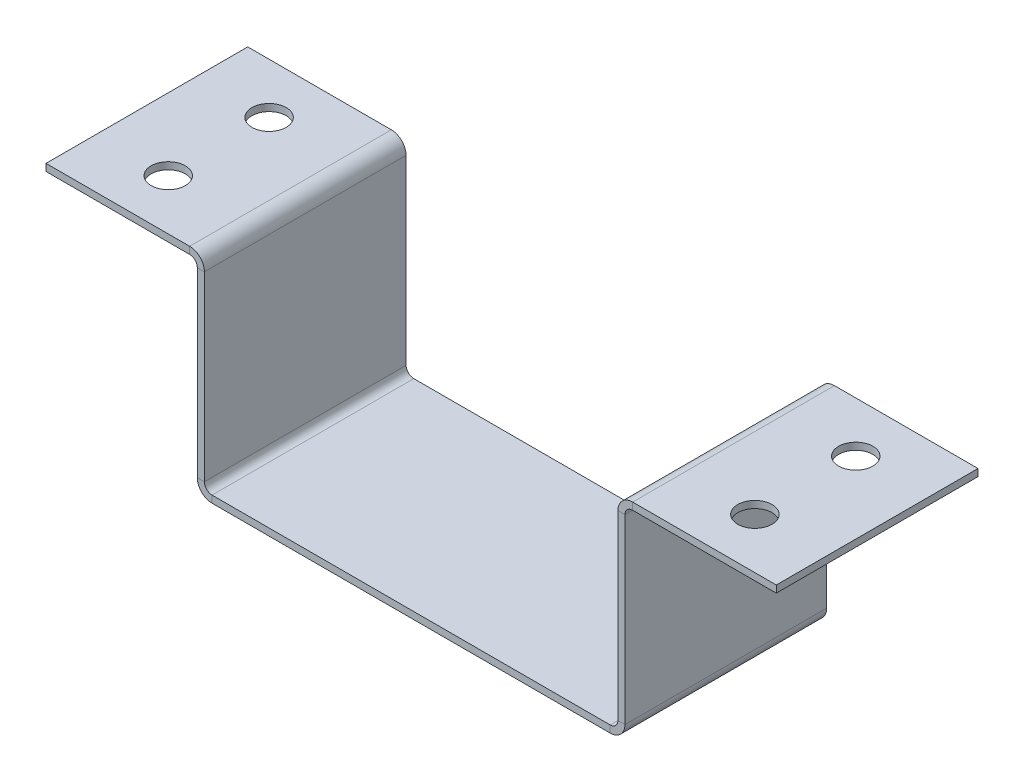
ISO-10303-21;
HEADER;
FILE_DESCRIPTION(('STEP AP214'),'2;1');
FILE_NAME('part.step','',(''),(''),'','','');
FILE_SCHEMA(('AUTOMOTIVE_DESIGN { 1 0 10303 214 1 1 1 1 }'));
ENDSEC;
DATA;
#1=APPLICATION_CONTEXT('core data for automotive mechanical design processes');
#2=APPLICATION_PROTOCOL_DEFINITION('international standard','automotive_design',2000,#1);
#3=PRODUCT_CONTEXT('',#1,'mechanical');
#4=PRODUCT('Part','Part','',(#3));
#5=PRODUCT_RELATED_PRODUCT_CATEGORY('part','',(#4));
#6=PRODUCT_DEFINITION_FORMATION('','',#4);
#7=PRODUCT_DEFINITION_CONTEXT('part definition',#1,'design');
#8=PRODUCT_DEFINITION('design','',#6,#7);
#9=PRODUCT_DEFINITION_SHAPE('','',#8);
#10=(LENGTH_UNIT() NAMED_UNIT(*) SI_UNIT(.MILLI.,.METRE.));
#11=(NAMED_UNIT(*) PLANE_ANGLE_UNIT() SI_UNIT($,.RADIAN.));
#12=(NAMED_UNIT(*) SI_UNIT($,.STERADIAN.) SOLID_ANGLE_UNIT());
#13=UNCERTAINTY_MEASURE_WITH_UNIT(LENGTH_MEASURE(1.E-05),#10,'distance_accuracy_value','');
#14=(GEOMETRIC_REPRESENTATION_CONTEXT(3) GLOBAL_UNCERTAINTY_ASSIGNED_CONTEXT((#13)) GLOBAL_UNIT_ASSIGNED_CONTEXT((#10,
#11,#12)) REPRESENTATION_CONTEXT('',''));
#15=CARTESIAN_POINT('',(0.,0.,0.));
#16=DIRECTION('',(0.,0.,1.));
#17=DIRECTION('',(1.,0.,0.));
#18=AXIS2_PLACEMENT_3D('',#15,#16,#17);
#19=CARTESIAN_POINT('',(-0.700000000000069,20.25,-20.));
#20=DIRECTION('',(0.,0.,-1.));
#21=DIRECTION('',(-1.,0.,0.));
#22=AXIS2_PLACEMENT_3D('',#19,#20,#21);
#23=PLANE('',#22);
#24=DIRECTION('',(0.,1.,0.));
#25=VECTOR('',#24,1.);
#26=CARTESIAN_POINT('',(-0.700000000000069,20.25,-20.));
#27=LINE('',#26,#25);
#28=CARTESIAN_POINT('',(-0.700000000000003,0.761999999999995,-20.));
#29=VERTEX_POINT('',#28);
#30=CARTESIAN_POINT('',(-0.700000000000063,18.788,-20.));
#31=VERTEX_POINT('',#30);
#32=EDGE_CURVE('E291',#29,#31,#27,.T.);
#33=ORIENTED_EDGE('',*,*,#32,.T.);
#34=DIRECTION('',(1.,0.,0.));
#35=VECTOR('',#34,1.);
#36=CARTESIAN_POINT('',(-0.700000000000063,18.788,-20.));
#37=LINE('',#36,#35);
#38=CARTESIAN_POINT('',(0.,18.788,-20.));
#39=VERTEX_POINT('',#38);
#40=EDGE_CURVE('E262',#31,#39,#37,.T.);
#41=ORIENTED_EDGE('',*,*,#40,.T.);
#42=DIRECTION('',(0.,1.,0.));
#43=VECTOR('',#42,1.);
#44=CARTESIAN_POINT('',(0.,20.25,-20.));
#45=LINE('',#44,#43);
#46=CARTESIAN_POINT('',(0.,0.761999999999997,-20.));
#47=VERTEX_POINT('',#46);
#48=EDGE_CURVE('E292',#47,#39,#45,.T.);
#49=ORIENTED_EDGE('',*,*,#48,.F.);
#50=DIRECTION('',(-1.,0.,0.));
#51=VECTOR('',#50,1.);
#52=CARTESIAN_POINT('',(0.,0.761999999999997,-20.));
#53=LINE('',#52,#51);
#54=EDGE_CURVE('E275',#47,#29,#53,.T.);
#55=ORIENTED_EDGE('',*,*,#54,.T.);
#56=EDGE_LOOP('',(#33,#41,#49,#55));
#57=FACE_BOUND('',#56,.T.);
#58=ADVANCED_FACE('F76',(#57),#23,.T.);
#59=CARTESIAN_POINT('',(-0.7,-1.42935222152102E-13,0.));
#60=DIRECTION('',(1.,0.,0.));
#61=DIRECTION('',(0.,-1.,0.));
#62=AXIS2_PLACEMENT_3D('',#59,#60,#61);
#63=PLANE('',#62);
#64=DIRECTION('',(0.,0.,-1.));
#65=VECTOR('',#64,1.);
#66=CARTESIAN_POINT('',(-0.700000000000063,18.788,-20.));
#67=LINE('',#66,#65);
#68=CARTESIAN_POINT('',(-0.700000000000063,18.788,0.));
#69=VERTEX_POINT('',#68);
#70=EDGE_CURVE('E268',#31,#69,#67,.F.);
#71=ORIENTED_EDGE('',*,*,#70,.F.);
#72=ORIENTED_EDGE('',*,*,#32,.F.);
#73=DIRECTION('',(0.,0.,-1.));
#74=VECTOR('',#73,1.);
#75=CARTESIAN_POINT('',(-0.700000000000003,0.761999999999995,0.));
#76=LINE('',#75,#74);
#77=CARTESIAN_POINT('',(-0.700000000000003,0.761999999999995,0.));
#78=VERTEX_POINT('',#77);
#79=EDGE_CURVE('E284',#78,#29,#76,.T.);
#80=ORIENTED_EDGE('',*,*,#79,.F.);
#81=DIRECTION('',(0.,-1.,0.));
#82=VECTOR('',#81,1.);
#83=CARTESIAN_POINT('',(-0.7,0.,0.));
#84=LINE('',#83,#82);
#85=EDGE_CURVE('E289',#69,#78,#84,.T.);
#86=ORIENTED_EDGE('',*,*,#85,.F.);
#87=EDGE_LOOP('',(#71,#72,#80,#86));
#88=FACE_BOUND('',#87,.T.);
#89=ADVANCED_FACE('F492',(#88),#63,.F.);
#90=CARTESIAN_POINT('',(0.,-1.40491185214912E-13,0.));
#91=DIRECTION('',(1.,0.,0.));
#92=DIRECTION('',(0.,-1.,0.));
#93=AXIS2_PLACEMENT_3D('',#90,#91,#92);
#94=PLANE('',#93);
#95=ORIENTED_EDGE('',*,*,#48,.T.);
#96=DIRECTION('',(0.,0.,-1.));
#97=VECTOR('',#96,1.);
#98=CARTESIAN_POINT('',(0.,18.788,-20.));
#99=LINE('',#98,#97);
#100=CARTESIAN_POINT('',(0.,18.788,0.));
#101=VERTEX_POINT('',#100);
#102=EDGE_CURVE('E257',#39,#101,#99,.F.);
#103=ORIENTED_EDGE('',*,*,#102,.T.);
#104=DIRECTION('',(0.,-1.,0.));
#105=VECTOR('',#104,1.);
#106=CARTESIAN_POINT('',(0.,0.,0.));
#107=LINE('',#106,#105);
#108=CARTESIAN_POINT('',(0.,0.761999999999997,0.));
#109=VERTEX_POINT('',#108);
#110=EDGE_CURVE('E288',#101,#109,#107,.T.);
#111=ORIENTED_EDGE('',*,*,#110,.T.);
#112=DIRECTION('',(0.,0.,1.));
#113=VECTOR('',#112,1.);
#114=CARTESIAN_POINT('',(0.,0.761999999999997,-20.));
#115=LINE('',#114,#113);
#116=EDGE_CURVE('E278',#47,#109,#115,.T.);
#117=ORIENTED_EDGE('',*,*,#116,.F.);
#118=EDGE_LOOP('',(#95,#103,#111,#117));
#119=FACE_BOUND('',#118,.T.);
#120=ADVANCED_FACE('F498',(#119),#94,.T.);
#121=CARTESIAN_POINT('',(0.,-0.7,0.));
#122=DIRECTION('',(0.,-1.,0.));
#123=DIRECTION('',(0.,0.,-1.));
#124=AXIS2_PLACEMENT_3D('',#121,#122,#123);
#125=PLANE('',#124);
#126=DIRECTION('',(1.,0.,0.));
#127=VECTOR('',#126,1.);
#128=CARTESIAN_POINT('',(0.,-0.7,0.));
#129=LINE('',#128,#127);
#130=CARTESIAN_POINT('',(0.761999999999998,-0.700000000000001,0.));
#131=VERTEX_POINT('',#130);
#132=CARTESIAN_POINT('',(40.238,-0.7,0.));
#133=VERTEX_POINT('',#132);
#134=EDGE_CURVE('E85',#131,#133,#129,.T.);
#135=ORIENTED_EDGE('',*,*,#134,.F.);
#136=DIRECTION('',(0.,0.,1.));
#137=VECTOR('',#136,1.);
#138=CARTESIAN_POINT('',(0.761999999999998,-0.700000000000001,0.));
#139=LINE('',#138,#137);
#140=CARTESIAN_POINT('',(0.761999999999999,-0.7,-20.));
#141=VERTEX_POINT('',#140);
#142=EDGE_CURVE('E299',#131,#141,#139,.F.);
#143=ORIENTED_EDGE('',*,*,#142,.T.);
#144=DIRECTION('',(-1.,0.,0.));
#145=VECTOR('',#144,1.);
#146=CARTESIAN_POINT('',(0.,-0.7,-20.));
#147=LINE('',#146,#145);
#148=CARTESIAN_POINT('',(40.238,-0.699999999999991,-20.));
#149=VERTEX_POINT('',#148);
#150=EDGE_CURVE('E13',#149,#141,#147,.T.);
#151=ORIENTED_EDGE('',*,*,#150,.F.);
#152=DIRECTION('',(0.,0.,-1.));
#153=VECTOR('',#152,1.);
#154=CARTESIAN_POINT('',(40.238,-0.699999999999991,-20.));
#155=LINE('',#154,#153);
#156=EDGE_CURVE('E393',#149,#133,#155,.F.);
#157=ORIENTED_EDGE('',*,*,#156,.T.);
#158=EDGE_LOOP('',(#135,#143,#151,#157));
#159=FACE_BOUND('',#158,.T.);
#160=ADVANCED_FACE('F433',(#159),#125,.T.);
#161=CARTESIAN_POINT('',(0.,0.,0.));
#162=DIRECTION('',(0.,-1.,0.));
#163=DIRECTION('',(0.,0.,-1.));
#164=AXIS2_PLACEMENT_3D('',#161,#162,#163);
#165=PLANE('',#164);
#166=DIRECTION('',(0.,0.,1.));
#167=VECTOR('',#166,1.);
#168=CARTESIAN_POINT('',(0.761999999999997,0.,0.));
#169=LINE('',#168,#167);
#170=CARTESIAN_POINT('',(0.761999999999997,0.,0.));
#171=VERTEX_POINT('',#170);
#172=CARTESIAN_POINT('',(0.761999999999999,0.,-20.));
#173=VERTEX_POINT('',#172);
#174=EDGE_CURVE('E312',#171,#173,#169,.F.);
#175=ORIENTED_EDGE('',*,*,#174,.F.);
#176=DIRECTION('',(1.,0.,0.));
#177=VECTOR('',#176,1.);
#178=CARTESIAN_POINT('',(0.,0.,0.));
#179=LINE('',#178,#177);
#180=CARTESIAN_POINT('',(40.238,0.,0.));
#181=VERTEX_POINT('',#180);
#182=EDGE_CURVE('E414',#171,#181,#179,.T.);
#183=ORIENTED_EDGE('',*,*,#182,.T.);
#184=DIRECTION('',(0.,0.,-1.));
#185=VECTOR('',#184,1.);
#186=CARTESIAN_POINT('',(40.238,0.,-20.));
#187=LINE('',#186,#185);
#188=CARTESIAN_POINT('',(40.238,0.,-20.));
#189=VERTEX_POINT('',#188);
#190=EDGE_CURVE('E406',#189,#181,#187,.F.);
#191=ORIENTED_EDGE('',*,*,#190,.F.);
#192=DIRECTION('',(-1.,0.,0.));
#193=VECTOR('',#192,1.);
#194=CARTESIAN_POINT('',(0.,0.,-20.));
#195=LINE('',#194,#193);
#196=EDGE_CURVE('E80',#189,#173,#195,.T.);
#197=ORIENTED_EDGE('',*,*,#196,.T.);
#198=EDGE_LOOP('',(#175,#183,#191,#197));
#199=FACE_BOUND('',#198,.T.);
#200=ADVANCED_FACE('F423',(#199),#165,.F.);
#201=CARTESIAN_POINT('',(0.,-0.7,0.));
#202=DIRECTION('',(0.,0.,1.));
#203=DIRECTION('',(1.,0.,0.));
#204=AXIS2_PLACEMENT_3D('',#201,#202,#203);
#205=PLANE('',#204);
#206=ORIENTED_EDGE('',*,*,#182,.F.);
#207=DIRECTION('',(0.,-1.,0.));
#208=VECTOR('',#207,1.);
#209=CARTESIAN_POINT('',(0.761999999999997,0.,0.));
#210=LINE('',#209,#208);
#211=EDGE_CURVE('E306',#171,#131,#210,.T.);
#212=ORIENTED_EDGE('',*,*,#211,.T.);
#213=ORIENTED_EDGE('',*,*,#134,.T.);
#214=DIRECTION('',(0.,-1.,0.));
#215=VECTOR('',#214,1.);
#216=CARTESIAN_POINT('',(40.238,0.,0.));
#217=LINE('',#216,#215);
#218=EDGE_CURVE('E411',#181,#133,#217,.T.);
#219=ORIENTED_EDGE('',*,*,#218,.F.);
#220=EDGE_LOOP('',(#206,#212,#213,#219));
#221=FACE_BOUND('',#220,.T.);
#222=ADVANCED_FACE('F78',(#221),#205,.T.);
#223=CARTESIAN_POINT('',(41.7,0.,0.));
#224=DIRECTION('',(0.,0.,-1.));
#225=DIRECTION('',(-1.,0.,0.));
#226=AXIS2_PLACEMENT_3D('',#223,#224,#225);
#227=PLANE('',#226);
#228=DIRECTION('',(-1.,0.,0.));
#229=VECTOR('',#228,1.);
#230=CARTESIAN_POINT('',(41.7000000000001,18.788,0.));
#231=LINE('',#230,#229);
#232=CARTESIAN_POINT('',(41.7000000000001,18.788,0.));
#233=VERTEX_POINT('',#232);
#234=CARTESIAN_POINT('',(41.0000000000001,18.788,0.));
#235=VERTEX_POINT('',#234);
#236=EDGE_CURVE('E357',#233,#235,#231,.T.);
#237=ORIENTED_EDGE('',*,*,#236,.T.);
#238=DIRECTION('',(0.,-1.,0.));
#239=VECTOR('',#238,1.);
#240=CARTESIAN_POINT('',(41.,0.,0.));
#241=LINE('',#240,#239);
#242=CARTESIAN_POINT('',(41.,0.761999999999999,0.));
#243=VERTEX_POINT('',#242);
#244=EDGE_CURVE('E382',#235,#243,#241,.T.);
#245=ORIENTED_EDGE('',*,*,#244,.T.);
#246=DIRECTION('',(1.,0.,0.));
#247=VECTOR('',#246,1.);
#248=CARTESIAN_POINT('',(41.,0.761999999999999,0.));
#249=LINE('',#248,#247);
#250=CARTESIAN_POINT('',(41.7,0.761999999999996,0.));
#251=VERTEX_POINT('',#250);
#252=EDGE_CURVE('E369',#243,#251,#249,.T.);
#253=ORIENTED_EDGE('',*,*,#252,.T.);
#254=DIRECTION('',(0.,-1.,0.));
#255=VECTOR('',#254,1.);
#256=CARTESIAN_POINT('',(41.7,0.,0.));
#257=LINE('',#256,#255);
#258=EDGE_CURVE('E383',#233,#251,#257,.T.);
#259=ORIENTED_EDGE('',*,*,#258,.F.);
#260=EDGE_LOOP('',(#237,#245,#253,#259));
#261=FACE_BOUND('',#260,.T.);
#262=ADVANCED_FACE('F479',(#261),#227,.F.);
#263=CARTESIAN_POINT('',(41.7000000000001,20.25,-20.));
#264=DIRECTION('',(0.,0.,1.));
#265=DIRECTION('',(1.,0.,0.));
#266=AXIS2_PLACEMENT_3D('',#263,#264,#265);
#267=PLANE('',#266);
#268=DIRECTION('',(-1.,0.,0.));
#269=VECTOR('',#268,1.);
#270=CARTESIAN_POINT('',(41.7000000000001,18.788,-20.));
#271=LINE('',#270,#269);
#272=CARTESIAN_POINT('',(41.7000000000001,18.788,-20.));
#273=VERTEX_POINT('',#272);
#274=CARTESIAN_POINT('',(41.0000000000001,18.788,-20.));
#275=VERTEX_POINT('',#274);
#276=EDGE_CURVE('E367',#273,#275,#271,.T.);
#277=ORIENTED_EDGE('',*,*,#276,.F.);
#278=DIRECTION('',(0.,1.,0.));
#279=VECTOR('',#278,1.);
#280=CARTESIAN_POINT('',(41.7000000000001,20.25,-20.));
#281=LINE('',#280,#279);
#282=CARTESIAN_POINT('',(41.7,0.761999999999996,-20.));
#283=VERTEX_POINT('',#282);
#284=EDGE_CURVE('E385',#283,#273,#281,.T.);
#285=ORIENTED_EDGE('',*,*,#284,.F.);
#286=DIRECTION('',(1.,0.,0.));
#287=VECTOR('',#286,1.);
#288=CARTESIAN_POINT('',(41.,0.761999999999999,-20.));
#289=LINE('',#288,#287);
#290=CARTESIAN_POINT('',(41.,0.761999999999999,-20.));
#291=VERTEX_POINT('',#290);
#292=EDGE_CURVE('E374',#291,#283,#289,.T.);
#293=ORIENTED_EDGE('',*,*,#292,.F.);
#294=DIRECTION('',(0.,1.,0.));
#295=VECTOR('',#294,1.);
#296=CARTESIAN_POINT('',(41.0000000000001,20.25,-20.));
#297=LINE('',#296,#295);
#298=EDGE_CURVE('E386',#291,#275,#297,.T.);
#299=ORIENTED_EDGE('',*,*,#298,.T.);
#300=EDGE_LOOP('',(#277,#285,#293,#299));
#301=FACE_BOUND('',#300,.T.);
#302=ADVANCED_FACE('F464',(#301),#267,.F.);
#303=CARTESIAN_POINT('',(41.7,-1.42935222152102E-13,0.));
#304=DIRECTION('',(-1.,0.,0.));
#305=DIRECTION('',(0.,-1.,0.));
#306=AXIS2_PLACEMENT_3D('',#303,#304,#305);
#307=PLANE('',#306);
#308=DIRECTION('',(0.,0.,1.));
#309=VECTOR('',#308,1.);
#310=CARTESIAN_POINT('',(41.7000000000001,18.788,0.));
#311=LINE('',#310,#309);
#312=EDGE_CURVE('E363',#233,#273,#311,.F.);
#313=ORIENTED_EDGE('',*,*,#312,.F.);
#314=ORIENTED_EDGE('',*,*,#258,.T.);
#315=DIRECTION('',(0.,0.,1.));
#316=VECTOR('',#315,1.);
#317=CARTESIAN_POINT('',(41.7,0.761999999999996,0.));
#318=LINE('',#317,#316);
#319=EDGE_CURVE('E377',#283,#251,#318,.T.);
#320=ORIENTED_EDGE('',*,*,#319,.F.);
#321=ORIENTED_EDGE('',*,*,#284,.T.);
#322=EDGE_LOOP('',(#313,#314,#320,#321));
#323=FACE_BOUND('',#322,.T.);
#324=ADVANCED_FACE('F461',(#323),#307,.F.);
#325=CARTESIAN_POINT('',(41.,-1.40491185214912E-13,0.));
#326=DIRECTION('',(-1.,0.,0.));
#327=DIRECTION('',(0.,-1.,0.));
#328=AXIS2_PLACEMENT_3D('',#325,#326,#327);
#329=PLANE('',#328);
#330=ORIENTED_EDGE('',*,*,#244,.F.);
#331=DIRECTION('',(0.,0.,1.));
#332=VECTOR('',#331,1.);
#333=CARTESIAN_POINT('',(41.0000000000001,18.788,0.));
#334=LINE('',#333,#332);
#335=EDGE_CURVE('E352',#235,#275,#334,.F.);
#336=ORIENTED_EDGE('',*,*,#335,.T.);
#337=ORIENTED_EDGE('',*,*,#298,.F.);
#338=DIRECTION('',(0.,0.,-1.));
#339=VECTOR('',#338,1.);
#340=CARTESIAN_POINT('',(41.,0.761999999999999,0.));
#341=LINE('',#340,#339);
#342=EDGE_CURVE('E372',#243,#291,#341,.T.);
#343=ORIENTED_EDGE('',*,*,#342,.F.);
#344=EDGE_LOOP('',(#330,#336,#337,#343));
#345=FACE_BOUND('',#344,.T.);
#346=ADVANCED_FACE('F470',(#345),#329,.T.);
#347=CARTESIAN_POINT('',(0.,-0.7,-20.));
#348=DIRECTION('',(0.,0.,-1.));
#349=DIRECTION('',(-1.,0.,0.));
#350=AXIS2_PLACEMENT_3D('',#347,#348,#349);
#351=PLANE('',#350);
#352=DIRECTION('',(0.,-1.,0.));
#353=VECTOR('',#352,1.);
#354=CARTESIAN_POINT('',(0.761999999999999,0.,-20.));
#355=LINE('',#354,#353);
#356=EDGE_CURVE('E316',#173,#141,#355,.T.);
#357=ORIENTED_EDGE('',*,*,#356,.F.);
#358=ORIENTED_EDGE('',*,*,#196,.F.);
#359=DIRECTION('',(0.,-1.,0.));
#360=VECTOR('',#359,1.);
#361=CARTESIAN_POINT('',(40.238,0.,-20.));
#362=LINE('',#361,#360);
#363=EDGE_CURVE('E400',#189,#149,#362,.T.);
#364=ORIENTED_EDGE('',*,*,#363,.T.);
#365=ORIENTED_EDGE('',*,*,#150,.T.);
#366=EDGE_LOOP('',(#357,#358,#364,#365));
#367=FACE_BOUND('',#366,.T.);
#368=ADVANCED_FACE('F426',(#367),#351,.T.);
#369=CARTESIAN_POINT('',(40.238,0.762000000000001,0.));
#370=DIRECTION('',(0.,0.,1.));
#371=DIRECTION('',(1.,0.,0.));
#372=AXIS2_PLACEMENT_3D('',#369,#370,#371);
#373=PLANE('',#372);
#374=ORIENTED_EDGE('',*,*,#252,.F.);
#375=CARTESIAN_POINT('',(40.238,0.762000000000001,0.));
#376=DIRECTION('',(0.,0.,-1.));
#377=DIRECTION('',(-1.,0.,0.));
#378=AXIS2_PLACEMENT_3D('',#375,#376,#377);
#379=CIRCLE('',#378,0.761999999999992);
#380=EDGE_CURVE('E403',#181,#243,#379,.F.);
#381=ORIENTED_EDGE('',*,*,#380,.F.);
#382=ORIENTED_EDGE('',*,*,#218,.T.);
#383=CARTESIAN_POINT('',(40.238,0.762000000000001,0.));
#384=DIRECTION('',(0.,0.,-1.));
#385=DIRECTION('',(-1.,0.,0.));
#386=AXIS2_PLACEMENT_3D('',#383,#384,#385);
#387=CIRCLE('',#386,1.46199999999999);
#388=EDGE_CURVE('E396',#133,#251,#387,.F.);
#389=ORIENTED_EDGE('',*,*,#388,.T.);
#390=EDGE_LOOP('',(#374,#381,#382,#389));
#391=FACE_BOUND('',#390,.T.);
#392=ADVANCED_FACE('F448',(#391),#373,.T.);
#393=CARTESIAN_POINT('',(40.238,0.762000000000001,-20.));
#394=DIRECTION('',(0.,0.,1.));
#395=DIRECTION('',(1.,0.,0.));
#396=AXIS2_PLACEMENT_3D('',#393,#394,#395);
#397=PLANE('',#396);
#398=CARTESIAN_POINT('',(40.238,0.762000000000001,-20.));
#399=DIRECTION('',(0.,0.,-1.));
#400=DIRECTION('',(-1.,0.,0.));
#401=AXIS2_PLACEMENT_3D('',#398,#399,#400);
#402=CIRCLE('',#401,0.761999999999992);
#403=EDGE_CURVE('E389',#291,#189,#402,.T.);
#404=ORIENTED_EDGE('',*,*,#403,.F.);
#405=ORIENTED_EDGE('',*,*,#292,.T.);
#406=CARTESIAN_POINT('',(40.238,0.762000000000001,-20.));
#407=DIRECTION('',(0.,0.,-1.));
#408=DIRECTION('',(-1.,0.,0.));
#409=AXIS2_PLACEMENT_3D('',#406,#407,#408);
#410=CIRCLE('',#409,1.46199999999999);
#411=EDGE_CURVE('E397',#283,#149,#410,.T.);
#412=ORIENTED_EDGE('',*,*,#411,.T.);
#413=ORIENTED_EDGE('',*,*,#363,.F.);
#414=EDGE_LOOP('',(#404,#405,#412,#413));
#415=FACE_BOUND('',#414,.T.);
#416=ADVANCED_FACE('F453',(#415),#397,.F.);
#417=CARTESIAN_POINT('',(40.238,0.762000000000001,-20.));
#418=DIRECTION('',(0.,0.,-1.));
#419=DIRECTION('',(1.,0.,0.));
#420=AXIS2_PLACEMENT_3D('',#417,#418,#419);
#421=CYLINDRICAL_SURFACE('',#420,1.46199999999999);
#422=ORIENTED_EDGE('',*,*,#156,.F.);
#423=ORIENTED_EDGE('',*,*,#411,.F.);
#424=ORIENTED_EDGE('',*,*,#319,.T.);
#425=ORIENTED_EDGE('',*,*,#388,.F.);
#426=EDGE_LOOP('',(#422,#423,#424,#425));
#427=FACE_BOUND('',#426,.T.);
#428=ADVANCED_FACE('F450',(#427),#421,.T.);
#429=CARTESIAN_POINT('',(40.238,0.762000000000001,-20.));
#430=DIRECTION('',(0.,0.,-1.));
#431=DIRECTION('',(1.,0.,0.));
#432=AXIS2_PLACEMENT_3D('',#429,#430,#431);
#433=CYLINDRICAL_SURFACE('',#432,0.761999999999992);
#434=ORIENTED_EDGE('',*,*,#190,.T.);
#435=ORIENTED_EDGE('',*,*,#380,.T.);
#436=ORIENTED_EDGE('',*,*,#342,.T.);
#437=ORIENTED_EDGE('',*,*,#403,.T.);
#438=EDGE_LOOP('',(#434,#435,#436,#437));
#439=FACE_BOUND('',#438,.T.);
#440=ADVANCED_FACE('F481',(#439),#433,.F.);
#441=CARTESIAN_POINT('',(42.4620000000001,18.788,-20.));
#442=DIRECTION('',(0.,0.,-1.));
#443=DIRECTION('',(-1.,0.,0.));
#444=AXIS2_PLACEMENT_3D('',#441,#442,#443);
#445=PLANE('',#444);
#446=DIRECTION('',(0.,-1.,0.));
#447=VECTOR('',#446,1.);
#448=CARTESIAN_POINT('',(42.4620000000001,20.25,-20.));
#449=LINE('',#448,#447);
#450=CARTESIAN_POINT('',(42.4620000000001,19.55,-20.));
#451=VERTEX_POINT('',#450);
#452=CARTESIAN_POINT('',(42.4620000000001,20.25,-20.));
#453=VERTEX_POINT('',#452);
#454=EDGE_CURVE('E319',#451,#453,#449,.F.);
#455=ORIENTED_EDGE('',*,*,#454,.F.);
#456=CARTESIAN_POINT('',(42.4620000000001,18.788,-20.));
#457=DIRECTION('',(0.,0.,1.));
#458=DIRECTION('',(1.,0.,0.));
#459=AXIS2_PLACEMENT_3D('',#456,#457,#458);
#460=CIRCLE('',#459,0.762000000000002);
#461=EDGE_CURVE('E360',#273,#451,#460,.F.);
#462=ORIENTED_EDGE('',*,*,#461,.F.);
#463=ORIENTED_EDGE('',*,*,#276,.T.);
#464=CARTESIAN_POINT('',(42.4620000000001,18.788,-20.));
#465=DIRECTION('',(0.,0.,1.));
#466=DIRECTION('',(1.,0.,0.));
#467=AXIS2_PLACEMENT_3D('',#464,#465,#466);
#468=CIRCLE('',#467,1.462);
#469=EDGE_CURVE('E101',#275,#453,#468,.F.);
#470=ORIENTED_EDGE('',*,*,#469,.T.);
#471=EDGE_LOOP('',(#455,#462,#463,#470));
#472=FACE_BOUND('',#471,.T.);
#473=ADVANCED_FACE('F467',(#472),#445,.T.);
#474=CARTESIAN_POINT('',(42.4620000000001,18.788,0.));
#475=DIRECTION('',(0.,0.,-1.));
#476=DIRECTION('',(-1.,0.,0.));
#477=AXIS2_PLACEMENT_3D('',#474,#475,#476);
#478=PLANE('',#477);
#479=CARTESIAN_POINT('',(42.4620000000001,18.788,0.));
#480=DIRECTION('',(0.,0.,1.));
#481=DIRECTION('',(1.,0.,0.));
#482=AXIS2_PLACEMENT_3D('',#479,#480,#481);
#483=CIRCLE('',#482,0.762000000000002);
#484=CARTESIAN_POINT('',(42.4620000000001,19.55,0.));
#485=VERTEX_POINT('',#484);
#486=EDGE_CURVE('E325',#485,#233,#483,.T.);
#487=ORIENTED_EDGE('',*,*,#486,.F.);
#488=DIRECTION('',(0.,-1.,0.));
#489=VECTOR('',#488,1.);
#490=CARTESIAN_POINT('',(42.4620000000001,19.55,0.));
#491=LINE('',#490,#489);
#492=CARTESIAN_POINT('',(42.4620000000001,20.25,0.));
#493=VERTEX_POINT('',#492);
#494=EDGE_CURVE('E345',#485,#493,#491,.F.);
#495=ORIENTED_EDGE('',*,*,#494,.T.);
#496=CARTESIAN_POINT('',(42.4620000000001,18.788,0.));
#497=DIRECTION('',(0.,0.,1.));
#498=DIRECTION('',(1.,0.,0.));
#499=AXIS2_PLACEMENT_3D('',#496,#497,#498);
#500=CIRCLE('',#499,1.462);
#501=EDGE_CURVE('E355',#493,#235,#500,.T.);
#502=ORIENTED_EDGE('',*,*,#501,.T.);
#503=ORIENTED_EDGE('',*,*,#236,.F.);
#504=EDGE_LOOP('',(#487,#495,#502,#503));
#505=FACE_BOUND('',#504,.T.);
#506=ADVANCED_FACE('F475',(#505),#478,.F.);
#507=CARTESIAN_POINT('',(42.4620000000001,18.788,0.));
#508=DIRECTION('',(0.,0.,1.));
#509=DIRECTION('',(0.,1.,0.));
#510=AXIS2_PLACEMENT_3D('',#507,#508,#509);
#511=CYLINDRICAL_SURFACE('',#510,1.462);
#512=ORIENTED_EDGE('',*,*,#335,.F.);
#513=ORIENTED_EDGE('',*,*,#501,.F.);
#514=DIRECTION('',(0.,0.,1.));
#515=VECTOR('',#514,1.);
#516=CARTESIAN_POINT('',(42.4620000000001,20.25,-20.));
#517=LINE('',#516,#515);
#518=EDGE_CURVE('E343',#493,#453,#517,.F.);
#519=ORIENTED_EDGE('',*,*,#518,.T.);
#520=ORIENTED_EDGE('',*,*,#469,.F.);
#521=EDGE_LOOP('',(#512,#513,#519,#520));
#522=FACE_BOUND('',#521,.T.);
#523=ADVANCED_FACE('F472',(#522),#511,.T.);
#524=CARTESIAN_POINT('',(42.4620000000001,18.788,0.));
#525=DIRECTION('',(0.,0.,1.));
#526=DIRECTION('',(0.,1.,0.));
#527=AXIS2_PLACEMENT_3D('',#524,#525,#526);
#528=CYLINDRICAL_SURFACE('',#527,0.762000000000002);
#529=ORIENTED_EDGE('',*,*,#312,.T.);
#530=ORIENTED_EDGE('',*,*,#461,.T.);
#531=DIRECTION('',(0.,0.,1.));
#532=VECTOR('',#531,1.);
#533=CARTESIAN_POINT('',(42.4620000000001,19.55,-20.));
#534=LINE('',#533,#532);
#535=EDGE_CURVE('E348',#451,#485,#534,.T.);
#536=ORIENTED_EDGE('',*,*,#535,.T.);
#537=ORIENTED_EDGE('',*,*,#486,.T.);
#538=EDGE_LOOP('',(#529,#530,#536,#537));
#539=FACE_BOUND('',#538,.T.);
#540=ADVANCED_FACE('F537',(#539),#528,.F.);
#541=CARTESIAN_POINT('',(41.7000000000001,20.25,-20.));
#542=DIRECTION('',(0.,0.,1.));
#543=DIRECTION('',(1.,0.,0.));
#544=AXIS2_PLACEMENT_3D('',#541,#542,#543);
#545=PLANE('',#544);
#546=ORIENTED_EDGE('',*,*,#454,.T.);
#547=DIRECTION('',(-1.,0.,0.));
#548=VECTOR('',#547,1.);
#549=CARTESIAN_POINT('',(0.,20.25,-20.));
#550=LINE('',#549,#548);
#551=CARTESIAN_POINT('',(56.7000000000001,20.25,-20.));
#552=VERTEX_POINT('',#551);
#553=EDGE_CURVE('E333',#552,#453,#550,.T.);
#554=ORIENTED_EDGE('',*,*,#553,.F.);
#555=DIRECTION('',(0.,-1.,0.));
#556=VECTOR('',#555,1.);
#557=CARTESIAN_POINT('',(56.7000000000001,20.25,-20.));
#558=LINE('',#557,#556);
#559=CARTESIAN_POINT('',(56.7000000000001,19.55,-20.));
#560=VERTEX_POINT('',#559);
#561=EDGE_CURVE('E326',#552,#560,#558,.T.);
#562=ORIENTED_EDGE('',*,*,#561,.T.);
#563=DIRECTION('',(1.,0.,0.));
#564=VECTOR('',#563,1.);
#565=CARTESIAN_POINT('',(41.7000000000001,19.55,-20.));
#566=LINE('',#565,#564);
#567=EDGE_CURVE('E340',#560,#451,#566,.F.);
#568=ORIENTED_EDGE('',*,*,#567,.T.);
#569=EDGE_LOOP('',(#546,#554,#562,#568));
#570=FACE_BOUND('',#569,.T.);
#571=ADVANCED_FACE('F533',(#570),#545,.F.);
#572=CARTESIAN_POINT('',(56.7000000000001,20.25,0.));
#573=DIRECTION('',(0.,0.,-1.));
#574=DIRECTION('',(-1.,0.,0.));
#575=AXIS2_PLACEMENT_3D('',#572,#573,#574);
#576=PLANE('',#575);
#577=ORIENTED_EDGE('',*,*,#494,.F.);
#578=DIRECTION('',(-1.,0.,0.));
#579=VECTOR('',#578,1.);
#580=CARTESIAN_POINT('',(56.7000000000001,19.55,0.));
#581=LINE('',#580,#579);
#582=CARTESIAN_POINT('',(56.7000000000001,19.55,0.));
#583=VERTEX_POINT('',#582);
#584=EDGE_CURVE('E338',#485,#583,#581,.F.);
#585=ORIENTED_EDGE('',*,*,#584,.T.);
#586=DIRECTION('',(0.,-1.,0.));
#587=VECTOR('',#586,1.);
#588=CARTESIAN_POINT('',(56.7000000000001,20.25,0.));
#589=LINE('',#588,#587);
#590=CARTESIAN_POINT('',(56.7000000000001,20.25,0.));
#591=VERTEX_POINT('',#590);
#592=EDGE_CURVE('E322',#591,#583,#589,.T.);
#593=ORIENTED_EDGE('',*,*,#592,.F.);
#594=DIRECTION('',(1.,0.,0.));
#595=VECTOR('',#594,1.);
#596=CARTESIAN_POINT('',(0.,20.25,0.));
#597=LINE('',#596,#595);
#598=EDGE_CURVE('E331',#493,#591,#597,.T.);
#599=ORIENTED_EDGE('',*,*,#598,.F.);
#600=EDGE_LOOP('',(#577,#585,#593,#599));
#601=FACE_BOUND('',#600,.T.);
#602=ADVANCED_FACE('F523',(#601),#576,.F.);
#603=CARTESIAN_POINT('',(0.,20.25,0.));
#604=DIRECTION('',(0.,-1.,0.));
#605=DIRECTION('',(0.,0.,-1.));
#606=AXIS2_PLACEMENT_3D('',#603,#604,#605);
#607=PLANE('',#606);
#608=CARTESIAN_POINT('',(49.5810000000001,20.25,-15.));
#609=DIRECTION('',(0.,1.,0.));
#610=DIRECTION('',(0.,0.,1.));
#611=AXIS2_PLACEMENT_3D('',#608,#609,#610);
#612=CIRCLE('',#611,1.69999999999999);
#613=CARTESIAN_POINT('',(49.5810000000001,20.25,-13.3));
#614=VERTEX_POINT('',#613);
#615=EDGE_CURVE('E885',#614,#614,#612,.T.);
#616=ORIENTED_EDGE('',*,*,#615,.F.);
#617=EDGE_LOOP('',(#616));
#618=FACE_BOUND('',#617,.T.);
#619=CARTESIAN_POINT('',(49.5810000000001,20.25,-5.));
#620=DIRECTION('',(0.,1.,0.));
#621=DIRECTION('',(0.,0.,1.));
#622=AXIS2_PLACEMENT_3D('',#619,#620,#621);
#623=CIRCLE('',#622,1.69999999999999);
#624=CARTESIAN_POINT('',(49.5810000000001,20.25,-3.30000000000001));
#625=VERTEX_POINT('',#624);
#626=EDGE_CURVE('E887',#625,#625,#623,.T.);
#627=ORIENTED_EDGE('',*,*,#626,.F.);
#628=EDGE_LOOP('',(#627));
#629=FACE_BOUND('',#628,.T.);
#630=ORIENTED_EDGE('',*,*,#518,.F.);
#631=ORIENTED_EDGE('',*,*,#598,.T.);
#632=DIRECTION('',(0.,0.,-1.));
#633=VECTOR('',#632,1.);
#634=CARTESIAN_POINT('',(56.7000000000001,20.25,0.));
#635=LINE('',#634,#633);
#636=EDGE_CURVE('E329',#591,#552,#635,.T.);
#637=ORIENTED_EDGE('',*,*,#636,.T.);
#638=ORIENTED_EDGE('',*,*,#553,.T.);
#639=EDGE_LOOP('',(#630,#631,#637,#638));
#640=FACE_BOUND('',#639,.T.);
#641=ADVANCED_FACE('F519',(#618,#629,#640),#607,.F.);
#642=CARTESIAN_POINT('',(0.,19.55,0.));
#643=DIRECTION('',(0.,-1.,0.));
#644=DIRECTION('',(0.,0.,-1.));
#645=AXIS2_PLACEMENT_3D('',#642,#643,#644);
#646=PLANE('',#645);
#647=CARTESIAN_POINT('',(49.5810000000001,19.55,-15.));
#648=DIRECTION('',(0.,1.,0.));
#649=DIRECTION('',(0.,0.,1.));
#650=AXIS2_PLACEMENT_3D('',#647,#648,#649);
#651=CIRCLE('',#650,1.7);
#652=CARTESIAN_POINT('',(49.5810000000001,19.55,-13.3));
#653=VERTEX_POINT('',#652);
#654=EDGE_CURVE('E882',#653,#653,#651,.T.);
#655=ORIENTED_EDGE('',*,*,#654,.T.);
#656=EDGE_LOOP('',(#655));
#657=FACE_BOUND('',#656,.T.);
#658=CARTESIAN_POINT('',(49.5810000000001,19.55,-5.));
#659=DIRECTION('',(0.,1.,0.));
#660=DIRECTION('',(0.,0.,1.));
#661=AXIS2_PLACEMENT_3D('',#658,#659,#660);
#662=CIRCLE('',#661,1.7);
#663=CARTESIAN_POINT('',(49.5810000000001,19.55,-3.3));
#664=VERTEX_POINT('',#663);
#665=EDGE_CURVE('E892',#664,#664,#662,.T.);
#666=ORIENTED_EDGE('',*,*,#665,.T.);
#667=EDGE_LOOP('',(#666));
#668=FACE_BOUND('',#667,.T.);
#669=ORIENTED_EDGE('',*,*,#584,.F.);
#670=ORIENTED_EDGE('',*,*,#535,.F.);
#671=ORIENTED_EDGE('',*,*,#567,.F.);
#672=DIRECTION('',(0.,0.,1.));
#673=VECTOR('',#672,1.);
#674=CARTESIAN_POINT('',(56.7000000000001,19.55,-20.));
#675=LINE('',#674,#673);
#676=EDGE_CURVE('E336',#583,#560,#675,.F.);
#677=ORIENTED_EDGE('',*,*,#676,.F.);
#678=EDGE_LOOP('',(#669,#670,#671,#677));
#679=FACE_BOUND('',#678,.T.);
#680=ADVANCED_FACE('F522',(#657,#668,#679),#646,.T.);
#681=CARTESIAN_POINT('',(56.7000000000001,20.25,-20.));
#682=DIRECTION('',(-1.,0.,0.));
#683=DIRECTION('',(0.,-1.,0.));
#684=AXIS2_PLACEMENT_3D('',#681,#682,#683);
#685=PLANE('',#684);
#686=ORIENTED_EDGE('',*,*,#676,.T.);
#687=ORIENTED_EDGE('',*,*,#561,.F.);
#688=ORIENTED_EDGE('',*,*,#636,.F.);
#689=ORIENTED_EDGE('',*,*,#592,.T.);
#690=EDGE_LOOP('',(#686,#687,#688,#689));
#691=FACE_BOUND('',#690,.T.);
#692=ADVANCED_FACE('F516',(#691),#685,.F.);
#693=CARTESIAN_POINT('',(0.761999999999998,0.762,-20.));
#694=DIRECTION('',(0.,0.,-1.));
#695=DIRECTION('',(-1.,0.,0.));
#696=AXIS2_PLACEMENT_3D('',#693,#694,#695);
#697=PLANE('',#696);
#698=ORIENTED_EDGE('',*,*,#54,.F.);
#699=CARTESIAN_POINT('',(0.761999999999998,0.762,-20.));
#700=DIRECTION('',(0.,0.,1.));
#701=DIRECTION('',(1.,0.,0.));
#702=AXIS2_PLACEMENT_3D('',#699,#700,#701);
#703=CIRCLE('',#702,0.762000000000001);
#704=EDGE_CURVE('E309',#173,#47,#703,.F.);
#705=ORIENTED_EDGE('',*,*,#704,.F.);
#706=ORIENTED_EDGE('',*,*,#356,.T.);
#707=CARTESIAN_POINT('',(0.761999999999998,0.762,-20.));
#708=DIRECTION('',(0.,0.,1.));
#709=DIRECTION('',(1.,0.,0.));
#710=AXIS2_PLACEMENT_3D('',#707,#708,#709);
#711=CIRCLE('',#710,1.462);
#712=EDGE_CURVE('E302',#141,#29,#711,.F.);
#713=ORIENTED_EDGE('',*,*,#712,.T.);
#714=EDGE_LOOP('',(#698,#705,#706,#713));
#715=FACE_BOUND('',#714,.T.);
#716=ADVANCED_FACE('F430',(#715),#697,.T.);
#717=CARTESIAN_POINT('',(0.761999999999997,0.762,0.));
#718=DIRECTION('',(0.,0.,-1.));
#719=DIRECTION('',(-1.,0.,0.));
#720=AXIS2_PLACEMENT_3D('',#717,#718,#719);
#721=PLANE('',#720);
#722=CARTESIAN_POINT('',(0.761999999999997,0.762,0.));
#723=DIRECTION('',(0.,0.,1.));
#724=DIRECTION('',(1.,0.,0.));
#725=AXIS2_PLACEMENT_3D('',#722,#723,#724);
#726=CIRCLE('',#725,0.762000000000001);
#727=EDGE_CURVE('E295',#109,#171,#726,.T.);
#728=ORIENTED_EDGE('',*,*,#727,.F.);
#729=DIRECTION('',(-1.,0.,0.));
#730=VECTOR('',#729,1.);
#731=CARTESIAN_POINT('',(0.,0.761999999999997,0.));
#732=LINE('',#731,#730);
#733=EDGE_CURVE('E281',#109,#78,#732,.T.);
#734=ORIENTED_EDGE('',*,*,#733,.T.);
#735=CARTESIAN_POINT('',(0.761999999999997,0.762,0.));
#736=DIRECTION('',(0.,0.,1.));
#737=DIRECTION('',(1.,0.,0.));
#738=AXIS2_PLACEMENT_3D('',#735,#736,#737);
#739=CIRCLE('',#738,1.462);
#740=EDGE_CURVE('E303',#78,#131,#739,.T.);
#741=ORIENTED_EDGE('',*,*,#740,.T.);
#742=ORIENTED_EDGE('',*,*,#211,.F.);
#743=EDGE_LOOP('',(#728,#734,#741,#742));
#744=FACE_BOUND('',#743,.T.);
#745=ADVANCED_FACE('F439',(#744),#721,.F.);
#746=CARTESIAN_POINT('',(0.761999999999997,0.762,0.));
#747=DIRECTION('',(0.,0.,1.));
#748=DIRECTION('',(-1.,0.,0.));
#749=AXIS2_PLACEMENT_3D('',#746,#747,#748);
#750=CYLINDRICAL_SURFACE('',#749,1.462);
#751=ORIENTED_EDGE('',*,*,#142,.F.);
#752=ORIENTED_EDGE('',*,*,#740,.F.);
#753=ORIENTED_EDGE('',*,*,#79,.T.);
#754=ORIENTED_EDGE('',*,*,#712,.F.);
#755=EDGE_LOOP('',(#751,#752,#753,#754));
#756=FACE_BOUND('',#755,.T.);
#757=ADVANCED_FACE('F436',(#756),#750,.T.);
#758=CARTESIAN_POINT('',(0.761999999999997,0.762,0.));
#759=DIRECTION('',(0.,0.,1.));
#760=DIRECTION('',(-1.,0.,0.));
#761=AXIS2_PLACEMENT_3D('',#758,#759,#760);
#762=CYLINDRICAL_SURFACE('',#761,0.762000000000001);
#763=ORIENTED_EDGE('',*,*,#174,.T.);
#764=ORIENTED_EDGE('',*,*,#704,.T.);
#765=ORIENTED_EDGE('',*,*,#116,.T.);
#766=ORIENTED_EDGE('',*,*,#727,.T.);
#767=EDGE_LOOP('',(#763,#764,#765,#766));
#768=FACE_BOUND('',#767,.T.);
#769=ADVANCED_FACE('F507',(#768),#762,.F.);
#770=CARTESIAN_POINT('',(-0.7,0.,0.));
#771=DIRECTION('',(0.,0.,1.));
#772=DIRECTION('',(1.,0.,0.));
#773=AXIS2_PLACEMENT_3D('',#770,#771,#772);
#774=PLANE('',#773);
#775=DIRECTION('',(1.,0.,0.));
#776=VECTOR('',#775,1.);
#777=CARTESIAN_POINT('',(-0.700000000000063,18.788,0.));
#778=LINE('',#777,#776);
#779=EDGE_CURVE('E273',#69,#101,#778,.T.);
#780=ORIENTED_EDGE('',*,*,#779,.F.);
#781=ORIENTED_EDGE('',*,*,#85,.T.);
#782=ORIENTED_EDGE('',*,*,#733,.F.);
#783=ORIENTED_EDGE('',*,*,#110,.F.);
#784=EDGE_LOOP('',(#780,#781,#782,#783));
#785=FACE_BOUND('',#784,.T.);
#786=ADVANCED_FACE('F503',(#785),#774,.T.);
#787=CARTESIAN_POINT('',(-1.46200000000007,18.788,0.));
#788=DIRECTION('',(0.,0.,1.));
#789=DIRECTION('',(1.,0.,0.));
#790=AXIS2_PLACEMENT_3D('',#787,#788,#789);
#791=PLANE('',#790);
#792=DIRECTION('',(0.,1.,0.));
#793=VECTOR('',#792,1.);
#794=CARTESIAN_POINT('',(-1.46200000000007,20.25,0.));
#795=LINE('',#794,#793);
#796=CARTESIAN_POINT('',(-1.46200000000007,19.55,0.));
#797=VERTEX_POINT('',#796);
#798=CARTESIAN_POINT('',(-1.46200000000007,20.25,0.));
#799=VERTEX_POINT('',#798);
#800=EDGE_CURVE('E222',#797,#799,#795,.T.);
#801=ORIENTED_EDGE('',*,*,#800,.F.);
#802=CARTESIAN_POINT('',(-1.46200000000007,18.788,0.));
#803=DIRECTION('',(0.,0.,-1.));
#804=DIRECTION('',(-1.,0.,0.));
#805=AXIS2_PLACEMENT_3D('',#802,#803,#804);
#806=CIRCLE('',#805,0.762000000000002);
#807=EDGE_CURVE('E265',#69,#797,#806,.F.);
#808=ORIENTED_EDGE('',*,*,#807,.F.);
#809=ORIENTED_EDGE('',*,*,#779,.T.);
#810=CARTESIAN_POINT('',(-1.46200000000007,18.788,0.));
#811=DIRECTION('',(0.,0.,-1.));
#812=DIRECTION('',(-1.,0.,0.));
#813=AXIS2_PLACEMENT_3D('',#810,#811,#812);
#814=CIRCLE('',#813,1.462);
#815=EDGE_CURVE('E93',#101,#799,#814,.F.);
#816=ORIENTED_EDGE('',*,*,#815,.T.);
#817=EDGE_LOOP('',(#801,#808,#809,#816));
#818=FACE_BOUND('',#817,.T.);
#819=ADVANCED_FACE('F506',(#818),#791,.T.);
#820=CARTESIAN_POINT('',(-1.46200000000007,18.788,-20.));
#821=DIRECTION('',(0.,0.,1.));
#822=DIRECTION('',(1.,0.,0.));
#823=AXIS2_PLACEMENT_3D('',#820,#821,#822);
#824=PLANE('',#823);
#825=CARTESIAN_POINT('',(-1.46200000000007,18.788,-20.));
#826=DIRECTION('',(0.,0.,-1.));
#827=DIRECTION('',(-1.,0.,0.));
#828=AXIS2_PLACEMENT_3D('',#825,#826,#827);
#829=CIRCLE('',#828,0.762000000000002);
#830=CARTESIAN_POINT('',(-1.46200000000007,19.55,-20.));
#831=VERTEX_POINT('',#830);
#832=EDGE_CURVE('E270',#831,#31,#829,.T.);
#833=ORIENTED_EDGE('',*,*,#832,.F.);
#834=DIRECTION('',(0.,1.,0.));
#835=VECTOR('',#834,1.);
#836=CARTESIAN_POINT('',(-1.46200000000007,19.55,-20.));
#837=LINE('',#836,#835);
#838=CARTESIAN_POINT('',(-1.46200000000007,20.25,-20.));
#839=VERTEX_POINT('',#838);
#840=EDGE_CURVE('E250',#831,#839,#837,.T.);
#841=ORIENTED_EDGE('',*,*,#840,.T.);
#842=CARTESIAN_POINT('',(-1.46200000000007,18.788,-20.));
#843=DIRECTION('',(0.,0.,-1.));
#844=DIRECTION('',(-1.,0.,0.));
#845=AXIS2_PLACEMENT_3D('',#842,#843,#844);
#846=CIRCLE('',#845,1.462);
#847=EDGE_CURVE('E260',#839,#39,#846,.T.);
#848=ORIENTED_EDGE('',*,*,#847,.T.);
#849=ORIENTED_EDGE('',*,*,#40,.F.);
#850=EDGE_LOOP('',(#833,#841,#848,#849));
#851=FACE_BOUND('',#850,.T.);
#852=ADVANCED_FACE('F741',(#851),#824,.F.);
#853=CARTESIAN_POINT('',(-1.46200000000007,18.788,-20.));
#854=DIRECTION('',(0.,0.,-1.));
#855=DIRECTION('',(0.,1.,0.));
#856=AXIS2_PLACEMENT_3D('',#853,#854,#855);
#857=CYLINDRICAL_SURFACE('',#856,1.462);
#858=ORIENTED_EDGE('',*,*,#102,.F.);
#859=ORIENTED_EDGE('',*,*,#847,.F.);
#860=DIRECTION('',(0.,0.,-1.));
#861=VECTOR('',#860,1.);
#862=CARTESIAN_POINT('',(-1.46200000000007,20.25,0.));
#863=LINE('',#862,#861);
#864=EDGE_CURVE('E248',#839,#799,#863,.F.);
#865=ORIENTED_EDGE('',*,*,#864,.T.);
#866=ORIENTED_EDGE('',*,*,#815,.F.);
#867=EDGE_LOOP('',(#858,#859,#865,#866));
#868=FACE_BOUND('',#867,.T.);
#869=ADVANCED_FACE('F751',(#868),#857,.T.);
#870=CARTESIAN_POINT('',(-1.46200000000007,18.788,-20.));
#871=DIRECTION('',(0.,0.,-1.));
#872=DIRECTION('',(0.,1.,0.));
#873=AXIS2_PLACEMENT_3D('',#870,#871,#872);
#874=CYLINDRICAL_SURFACE('',#873,0.762000000000002);
#875=ORIENTED_EDGE('',*,*,#70,.T.);
#876=ORIENTED_EDGE('',*,*,#807,.T.);
#877=DIRECTION('',(0.,0.,-1.));
#878=VECTOR('',#877,1.);
#879=CARTESIAN_POINT('',(-1.46200000000007,19.55,0.));
#880=LINE('',#879,#878);
#881=EDGE_CURVE('E253',#797,#831,#880,.T.);
#882=ORIENTED_EDGE('',*,*,#881,.T.);
#883=ORIENTED_EDGE('',*,*,#832,.T.);
#884=EDGE_LOOP('',(#875,#876,#882,#883));
#885=FACE_BOUND('',#884,.T.);
#886=ADVANCED_FACE('F762',(#885),#874,.F.);
#887=CARTESIAN_POINT('',(-0.700000000000066,20.25,-20.));
#888=DIRECTION('',(0.,0.,-1.));
#889=DIRECTION('',(-1.,0.,0.));
#890=AXIS2_PLACEMENT_3D('',#887,#888,#889);
#891=PLANE('',#890);
#892=DIRECTION('',(-1.,0.,0.));
#893=VECTOR('',#892,1.);
#894=CARTESIAN_POINT('',(-0.700000000000066,20.25,-20.));
#895=LINE('',#894,#893);
#896=CARTESIAN_POINT('',(-15.7000000000001,20.25,-20.));
#897=VERTEX_POINT('',#896);
#898=EDGE_CURVE('E238',#897,#839,#895,.F.);
#899=ORIENTED_EDGE('',*,*,#898,.T.);
#900=ORIENTED_EDGE('',*,*,#840,.F.);
#901=DIRECTION('',(1.,0.,0.));
#902=VECTOR('',#901,1.);
#903=CARTESIAN_POINT('',(41.,19.55,-20.));
#904=LINE('',#903,#902);
#905=CARTESIAN_POINT('',(-15.7000000000001,19.55,-20.));
#906=VERTEX_POINT('',#905);
#907=EDGE_CURVE('E245',#906,#831,#904,.T.);
#908=ORIENTED_EDGE('',*,*,#907,.F.);
#909=DIRECTION('',(0.,-1.,0.));
#910=VECTOR('',#909,1.);
#911=CARTESIAN_POINT('',(-15.7000000000001,20.25,-20.));
#912=LINE('',#911,#910);
#913=EDGE_CURVE('E233',#897,#906,#912,.T.);
#914=ORIENTED_EDGE('',*,*,#913,.F.);
#915=EDGE_LOOP('',(#899,#900,#908,#914));
#916=FACE_BOUND('',#915,.T.);
#917=ADVANCED_FACE('F772',(#916),#891,.T.);
#918=CARTESIAN_POINT('',(-15.7000000000001,20.25,0.));
#919=DIRECTION('',(0.,0.,1.));
#920=DIRECTION('',(1.,0.,0.));
#921=AXIS2_PLACEMENT_3D('',#918,#919,#920);
#922=PLANE('',#921);
#923=DIRECTION('',(-1.,0.,0.));
#924=VECTOR('',#923,1.);
#925=CARTESIAN_POINT('',(41.,19.55,0.));
#926=LINE('',#925,#924);
#927=CARTESIAN_POINT('',(-15.7000000000001,19.55,0.));
#928=VERTEX_POINT('',#927);
#929=EDGE_CURVE('E240',#797,#928,#926,.T.);
#930=ORIENTED_EDGE('',*,*,#929,.F.);
#931=ORIENTED_EDGE('',*,*,#800,.T.);
#932=DIRECTION('',(1.,0.,0.));
#933=VECTOR('',#932,1.);
#934=CARTESIAN_POINT('',(-15.7000000000001,20.25,0.));
#935=LINE('',#934,#933);
#936=CARTESIAN_POINT('',(-15.7000000000001,20.25,0.));
#937=VERTEX_POINT('',#936);
#938=EDGE_CURVE('E216',#799,#937,#935,.F.);
#939=ORIENTED_EDGE('',*,*,#938,.T.);
#940=DIRECTION('',(0.,-1.,0.));
#941=VECTOR('',#940,1.);
#942=CARTESIAN_POINT('',(-15.7000000000001,20.25,0.));
#943=LINE('',#942,#941);
#944=EDGE_CURVE('E220',#937,#928,#943,.T.);
#945=ORIENTED_EDGE('',*,*,#944,.T.);
#946=EDGE_LOOP('',(#930,#931,#939,#945));
#947=FACE_BOUND('',#946,.T.);
#948=ADVANCED_FACE('F219',(#947),#922,.T.);
#949=CARTESIAN_POINT('',(41.,20.25,0.));
#950=DIRECTION('',(0.,-1.,0.));
#951=DIRECTION('',(0.,0.,-1.));
#952=AXIS2_PLACEMENT_3D('',#949,#950,#951);
#953=PLANE('',#952);
#954=CARTESIAN_POINT('',(-8.58100000000006,20.25,-15.));
#955=DIRECTION('',(0.,1.,0.));
#956=DIRECTION('',(0.,0.,1.));
#957=AXIS2_PLACEMENT_3D('',#954,#955,#956);
#958=CIRCLE('',#957,1.69999999999999);
#959=CARTESIAN_POINT('',(-8.58100000000006,20.25,-13.3));
#960=VERTEX_POINT('',#959);
#961=EDGE_CURVE('E895',#960,#960,#958,.T.);
#962=ORIENTED_EDGE('',*,*,#961,.F.);
#963=EDGE_LOOP('',(#962));
#964=FACE_BOUND('',#963,.T.);
#965=CARTESIAN_POINT('',(-8.58100000000006,20.25,-5.));
#966=DIRECTION('',(0.,1.,0.));
#967=DIRECTION('',(0.,0.,1.));
#968=AXIS2_PLACEMENT_3D('',#965,#966,#967);
#969=CIRCLE('',#968,1.69999999999999);
#970=CARTESIAN_POINT('',(-8.58100000000006,20.25,-3.30000000000001));
#971=VERTEX_POINT('',#970);
#972=EDGE_CURVE('E901',#971,#971,#969,.T.);
#973=ORIENTED_EDGE('',*,*,#972,.F.);
#974=EDGE_LOOP('',(#973));
#975=FACE_BOUND('',#974,.T.);
#976=ORIENTED_EDGE('',*,*,#864,.F.);
#977=ORIENTED_EDGE('',*,*,#898,.F.);
#978=DIRECTION('',(0.,0.,1.));
#979=VECTOR('',#978,1.);
#980=CARTESIAN_POINT('',(-15.7000000000001,20.25,-20.));
#981=LINE('',#980,#979);
#982=EDGE_CURVE('E226',#937,#897,#981,.F.);
#983=ORIENTED_EDGE('',*,*,#982,.F.);
#984=ORIENTED_EDGE('',*,*,#938,.F.);
#985=EDGE_LOOP('',(#976,#977,#983,#984));
#986=FACE_BOUND('',#985,.T.);
#987=ADVANCED_FACE('F236',(#964,#975,#986),#953,.F.);
#988=CARTESIAN_POINT('',(41.,19.55,0.));
#989=DIRECTION('',(0.,-1.,0.));
#990=DIRECTION('',(0.,0.,-1.));
#991=AXIS2_PLACEMENT_3D('',#988,#989,#990);
#992=PLANE('',#991);
#993=CARTESIAN_POINT('',(-8.58100000000006,19.55,-15.));
#994=DIRECTION('',(0.,-1.,0.));
#995=DIRECTION('',(0.,0.,-1.));
#996=AXIS2_PLACEMENT_3D('',#993,#994,#995);
#997=CIRCLE('',#996,1.69999999999999);
#998=CARTESIAN_POINT('',(-8.58100000000006,19.55,-16.7));
#999=VERTEX_POINT('',#998);
#1000=EDGE_CURVE('E898',#999,#999,#997,.F.);
#1001=ORIENTED_EDGE('',*,*,#1000,.T.);
#1002=EDGE_LOOP('',(#1001));
#1003=FACE_BOUND('',#1002,.T.);
#1004=CARTESIAN_POINT('',(-8.58100000000006,19.55,-5.));
#1005=DIRECTION('',(0.,-1.,0.));
#1006=DIRECTION('',(0.,0.,-1.));
#1007=AXIS2_PLACEMENT_3D('',#1004,#1005,#1006);
#1008=CIRCLE('',#1007,1.69999999999999);
#1009=CARTESIAN_POINT('',(-8.58100000000006,19.55,-6.69999999999999));
#1010=VERTEX_POINT('',#1009);
#1011=EDGE_CURVE('E256',#1010,#1010,#1008,.F.);
#1012=ORIENTED_EDGE('',*,*,#1011,.T.);
#1013=EDGE_LOOP('',(#1012));
#1014=FACE_BOUND('',#1013,.T.);
#1015=ORIENTED_EDGE('',*,*,#907,.T.);
#1016=ORIENTED_EDGE('',*,*,#881,.F.);
#1017=ORIENTED_EDGE('',*,*,#929,.T.);
#1018=DIRECTION('',(0.,0.,-1.));
#1019=VECTOR('',#1018,1.);
#1020=CARTESIAN_POINT('',(-15.7000000000001,19.55,0.));
#1021=LINE('',#1020,#1019);
#1022=EDGE_CURVE('E232',#928,#906,#1021,.T.);
#1023=ORIENTED_EDGE('',*,*,#1022,.T.);
#1024=EDGE_LOOP('',(#1015,#1016,#1017,#1023));
#1025=FACE_BOUND('',#1024,.T.);
#1026=ADVANCED_FACE('F805',(#1003,#1014,#1025),#992,.T.);
#1027=CARTESIAN_POINT('',(-15.7000000000001,20.25,-20.));
#1028=DIRECTION('',(-1.,0.,0.));
#1029=DIRECTION('',(0.,-1.,0.));
#1030=AXIS2_PLACEMENT_3D('',#1027,#1028,#1029);
#1031=PLANE('',#1030);
#1032=ORIENTED_EDGE('',*,*,#1022,.F.);
#1033=ORIENTED_EDGE('',*,*,#944,.F.);
#1034=ORIENTED_EDGE('',*,*,#982,.T.);
#1035=ORIENTED_EDGE('',*,*,#913,.T.);
#1036=EDGE_LOOP('',(#1032,#1033,#1034,#1035));
#1037=FACE_BOUND('',#1036,.T.);
#1038=ADVANCED_FACE('F230',(#1037),#1031,.T.);
#1039=CARTESIAN_POINT('',(-8.58100000000006,20.25,-5.));
#1040=DIRECTION('',(0.,1.,0.));
#1041=DIRECTION('',(0.,0.,1.));
#1042=AXIS2_PLACEMENT_3D('',#1039,#1040,#1041);
#1043=CYLINDRICAL_SURFACE('',#1042,1.69999999999999);
#1044=ORIENTED_EDGE('',*,*,#1011,.F.);
#1045=EDGE_LOOP('',(#1044));
#1046=FACE_BOUND('',#1045,.T.);
#1047=ORIENTED_EDGE('',*,*,#972,.T.);
#1048=EDGE_LOOP('',(#1047));
#1049=FACE_BOUND('',#1048,.T.);
#1050=ADVANCED_FACE('F804',(#1046,#1049),#1043,.F.);
#1051=CARTESIAN_POINT('',(-8.58100000000006,20.25,-15.));
#1052=DIRECTION('',(0.,1.,0.));
#1053=DIRECTION('',(0.,0.,1.));
#1054=AXIS2_PLACEMENT_3D('',#1051,#1052,#1053);
#1055=CYLINDRICAL_SURFACE('',#1054,1.69999999999999);
#1056=ORIENTED_EDGE('',*,*,#1000,.F.);
#1057=EDGE_LOOP('',(#1056));
#1058=FACE_BOUND('',#1057,.T.);
#1059=ORIENTED_EDGE('',*,*,#961,.T.);
#1060=EDGE_LOOP('',(#1059));
#1061=FACE_BOUND('',#1060,.T.);
#1062=ADVANCED_FACE('F845',(#1058,#1061),#1055,.F.);
#1063=CARTESIAN_POINT('',(49.5810000000001,20.25,-5.));
#1064=DIRECTION('',(0.,1.,0.));
#1065=DIRECTION('',(0.,0.,1.));
#1066=AXIS2_PLACEMENT_3D('',#1063,#1064,#1065);
#1067=CYLINDRICAL_SURFACE('',#1066,1.7);
#1068=ORIENTED_EDGE('',*,*,#665,.F.);
#1069=EDGE_LOOP('',(#1068));
#1070=FACE_BOUND('',#1069,.T.);
#1071=ORIENTED_EDGE('',*,*,#626,.T.);
#1072=EDGE_LOOP('',(#1071));
#1073=FACE_BOUND('',#1072,.T.);
#1074=ADVANCED_FACE('F855',(#1070,#1073),#1067,.F.);
#1075=CARTESIAN_POINT('',(49.5810000000001,20.25,-15.));
#1076=DIRECTION('',(0.,1.,0.));
#1077=DIRECTION('',(0.,0.,1.));
#1078=AXIS2_PLACEMENT_3D('',#1075,#1076,#1077);
#1079=CYLINDRICAL_SURFACE('',#1078,1.7);
#1080=ORIENTED_EDGE('',*,*,#654,.F.);
#1081=EDGE_LOOP('',(#1080));
#1082=FACE_BOUND('',#1081,.T.);
#1083=ORIENTED_EDGE('',*,*,#615,.T.);
#1084=EDGE_LOOP('',(#1083));
#1085=FACE_BOUND('',#1084,.T.);
#1086=ADVANCED_FACE('F865',(#1082,#1085),#1079,.F.);
#1087=CLOSED_SHELL('',(#58,#89,#120,#160,#200,#222,#262,#302,#324,#346,#368,#392,#416,#428,#440,
#473,#506,#523,#540,#571,#602,#641,#680,#692,#716,#745,#757,#769,#786,#819,#852,#869,#886,#917,
#948,#987,#1026,#1038,#1050,#1062,#1074,#1086));
#1088=MANIFOLD_SOLID_BREP('B2',#1087);
#1089=ADVANCED_BREP_SHAPE_REPRESENTATION('',(#18,#1088),#14);
#1090=SHAPE_DEFINITION_REPRESENTATION(#9,#1089);
ENDSEC;
END-ISO-10303-21;
